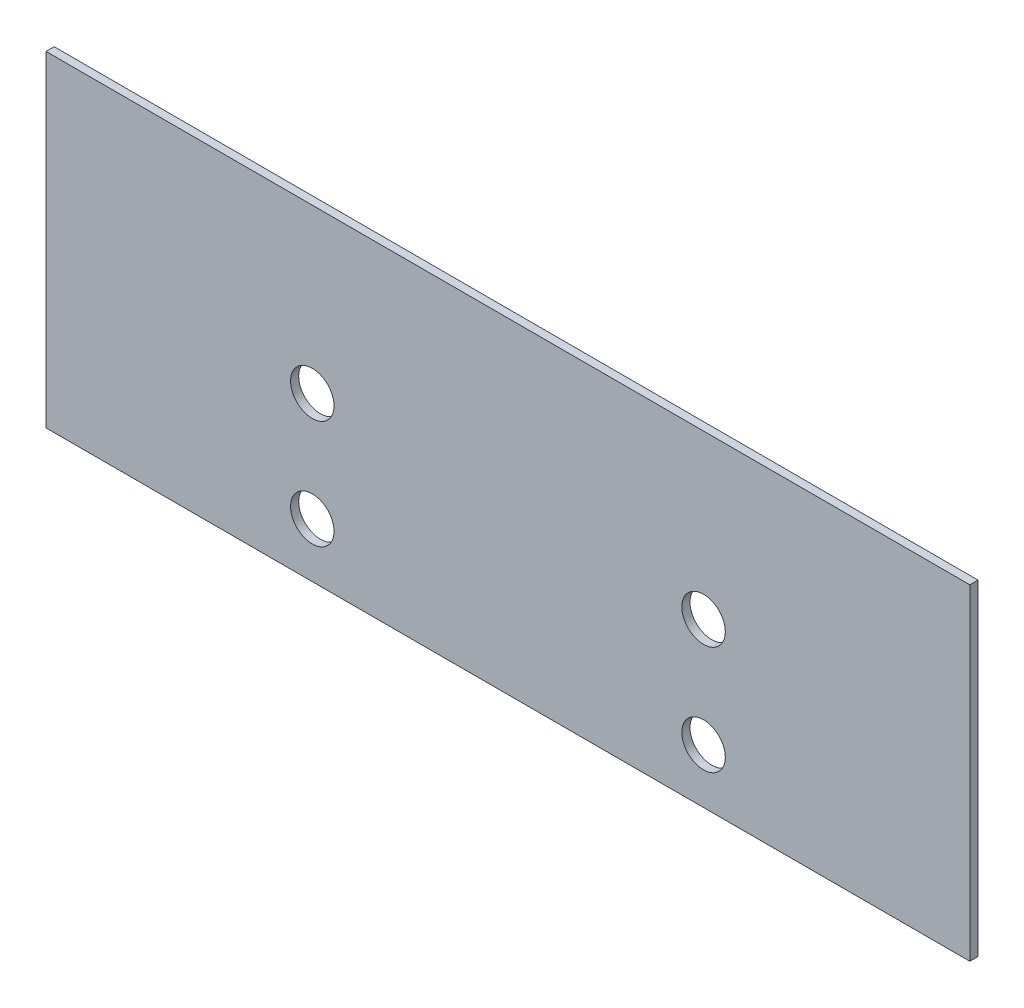
ISO-10303-21;
HEADER;
FILE_DESCRIPTION(('STEP AP214'),'2;1');
FILE_NAME('part.step','',(''),(''),'','','');
FILE_SCHEMA(('AUTOMOTIVE_DESIGN { 1 0 10303 214 1 1 1 1 }'));
ENDSEC;
DATA;
#1=APPLICATION_CONTEXT('core data for automotive mechanical design processes');
#2=APPLICATION_PROTOCOL_DEFINITION('international standard','automotive_design',2000,#1);
#3=PRODUCT_CONTEXT('',#1,'mechanical');
#4=PRODUCT('Part','Part','',(#3));
#5=PRODUCT_RELATED_PRODUCT_CATEGORY('part','',(#4));
#6=PRODUCT_DEFINITION_FORMATION('','',#4);
#7=PRODUCT_DEFINITION_CONTEXT('part definition',#1,'design');
#8=PRODUCT_DEFINITION('design','',#6,#7);
#9=PRODUCT_DEFINITION_SHAPE('','',#8);
#10=(LENGTH_UNIT() NAMED_UNIT(*) SI_UNIT(.MILLI.,.METRE.));
#11=(NAMED_UNIT(*) PLANE_ANGLE_UNIT() SI_UNIT($,.RADIAN.));
#12=(NAMED_UNIT(*) SI_UNIT($,.STERADIAN.) SOLID_ANGLE_UNIT());
#13=UNCERTAINTY_MEASURE_WITH_UNIT(LENGTH_MEASURE(1.E-05),#10,'distance_accuracy_value','');
#14=(GEOMETRIC_REPRESENTATION_CONTEXT(3) GLOBAL_UNCERTAINTY_ASSIGNED_CONTEXT((#13)) GLOBAL_UNIT_ASSIGNED_CONTEXT((#10,
#11,#12)) REPRESENTATION_CONTEXT('',''));
#15=CARTESIAN_POINT('',(0.,0.,0.));
#16=DIRECTION('',(0.,0.,1.));
#17=DIRECTION('',(1.,0.,0.));
#18=AXIS2_PLACEMENT_3D('',#15,#16,#17);
#19=CARTESIAN_POINT('',(85.0000000000001,-30.,1.5));
#20=DIRECTION('',(-1.,0.,0.));
#21=DIRECTION('',(0.,-1.,0.));
#22=AXIS2_PLACEMENT_3D('',#19,#20,#21);
#23=PLANE('',#22);
#24=DIRECTION('',(0.,1.,0.));
#25=VECTOR('',#24,1.);
#26=CARTESIAN_POINT('',(85.0000000000001,-30.,0.));
#27=LINE('',#26,#25);
#28=CARTESIAN_POINT('',(85.0000000000001,-30.,0.));
#29=VERTEX_POINT('',#28);
#30=CARTESIAN_POINT('',(85.0000000000001,30.,0.));
#31=VERTEX_POINT('',#30);
#32=EDGE_CURVE('E99',#29,#31,#27,.T.);
#33=ORIENTED_EDGE('',*,*,#32,.T.);
#34=DIRECTION('',(0.,0.,-1.));
#35=VECTOR('',#34,1.);
#36=CARTESIAN_POINT('',(85.0000000000001,30.,1.5));
#37=LINE('',#36,#35);
#38=CARTESIAN_POINT('',(85.0000000000001,30.,1.5));
#39=VERTEX_POINT('',#38);
#40=EDGE_CURVE('E11',#39,#31,#37,.T.);
#41=ORIENTED_EDGE('',*,*,#40,.F.);
#42=DIRECTION('',(0.,1.,0.));
#43=VECTOR('',#42,1.);
#44=CARTESIAN_POINT('',(85.0000000000001,-30.,1.5));
#45=LINE('',#44,#43);
#46=CARTESIAN_POINT('',(85.0000000000001,-30.,1.5));
#47=VERTEX_POINT('',#46);
#48=EDGE_CURVE('E87',#47,#39,#45,.T.);
#49=ORIENTED_EDGE('',*,*,#48,.F.);
#50=DIRECTION('',(0.,0.,-1.));
#51=VECTOR('',#50,1.);
#52=CARTESIAN_POINT('',(85.0000000000001,-30.,1.5));
#53=LINE('',#52,#51);
#54=EDGE_CURVE('E95',#47,#29,#53,.T.);
#55=ORIENTED_EDGE('',*,*,#54,.T.);
#56=EDGE_LOOP('',(#33,#41,#49,#55));
#57=FACE_BOUND('',#56,.T.);
#58=ADVANCED_FACE('F36',(#57),#23,.F.);
#59=CARTESIAN_POINT('',(-85.,30.,1.5));
#60=DIRECTION('',(0.,-1.,0.));
#61=DIRECTION('',(1.,0.,0.));
#62=AXIS2_PLACEMENT_3D('',#59,#60,#61);
#63=PLANE('',#62);
#64=DIRECTION('',(-1.,0.,0.));
#65=VECTOR('',#64,1.);
#66=CARTESIAN_POINT('',(-85.,30.,0.));
#67=LINE('',#66,#65);
#68=CARTESIAN_POINT('',(-85.,30.,0.));
#69=VERTEX_POINT('',#68);
#70=EDGE_CURVE('E91',#31,#69,#67,.T.);
#71=ORIENTED_EDGE('',*,*,#70,.T.);
#72=DIRECTION('',(0.,0.,-1.));
#73=VECTOR('',#72,1.);
#74=CARTESIAN_POINT('',(-85.,30.,1.5));
#75=LINE('',#74,#73);
#76=CARTESIAN_POINT('',(-85.,30.,1.5));
#77=VERTEX_POINT('',#76);
#78=EDGE_CURVE('E44',#77,#69,#75,.T.);
#79=ORIENTED_EDGE('',*,*,#78,.F.);
#80=DIRECTION('',(-1.,0.,0.));
#81=VECTOR('',#80,1.);
#82=CARTESIAN_POINT('',(-85.,30.,1.5));
#83=LINE('',#82,#81);
#84=EDGE_CURVE('E82',#39,#77,#83,.T.);
#85=ORIENTED_EDGE('',*,*,#84,.F.);
#86=ORIENTED_EDGE('',*,*,#40,.T.);
#87=EDGE_LOOP('',(#71,#79,#85,#86));
#88=FACE_BOUND('',#87,.T.);
#89=ADVANCED_FACE('F90',(#88),#63,.F.);
#90=CARTESIAN_POINT('',(-85.,-30.,1.5));
#91=DIRECTION('',(1.,0.,0.));
#92=DIRECTION('',(0.,0.,-1.));
#93=AXIS2_PLACEMENT_3D('',#90,#91,#92);
#94=PLANE('',#93);
#95=DIRECTION('',(0.,-1.,0.));
#96=VECTOR('',#95,1.);
#97=CARTESIAN_POINT('',(-85.,-30.,0.));
#98=LINE('',#97,#96);
#99=CARTESIAN_POINT('',(-85.,-30.,0.));
#100=VERTEX_POINT('',#99);
#101=EDGE_CURVE('E69',#69,#100,#98,.T.);
#102=ORIENTED_EDGE('',*,*,#101,.T.);
#103=DIRECTION('',(0.,0.,-1.));
#104=VECTOR('',#103,1.);
#105=CARTESIAN_POINT('',(-85.,-30.,1.5));
#106=LINE('',#105,#104);
#107=CARTESIAN_POINT('',(-85.,-30.,1.5));
#108=VERTEX_POINT('',#107);
#109=EDGE_CURVE('E92',#108,#100,#106,.T.);
#110=ORIENTED_EDGE('',*,*,#109,.F.);
#111=DIRECTION('',(0.,-1.,0.));
#112=VECTOR('',#111,1.);
#113=CARTESIAN_POINT('',(-85.,-30.,1.5));
#114=LINE('',#113,#112);
#115=EDGE_CURVE('E85',#77,#108,#114,.T.);
#116=ORIENTED_EDGE('',*,*,#115,.F.);
#117=ORIENTED_EDGE('',*,*,#78,.T.);
#118=EDGE_LOOP('',(#102,#110,#116,#117));
#119=FACE_BOUND('',#118,.T.);
#120=ADVANCED_FACE('F93',(#119),#94,.F.);
#121=CARTESIAN_POINT('',(-85.,-30.,1.5));
#122=DIRECTION('',(0.,1.,0.));
#123=DIRECTION('',(-1.,0.,0.));
#124=AXIS2_PLACEMENT_3D('',#121,#122,#123);
#125=PLANE('',#124);
#126=DIRECTION('',(1.,0.,0.));
#127=VECTOR('',#126,1.);
#128=CARTESIAN_POINT('',(-85.,-30.,0.));
#129=LINE('',#128,#127);
#130=EDGE_CURVE('E75',#100,#29,#129,.T.);
#131=ORIENTED_EDGE('',*,*,#130,.T.);
#132=ORIENTED_EDGE('',*,*,#54,.F.);
#133=DIRECTION('',(1.,0.,0.));
#134=VECTOR('',#133,1.);
#135=CARTESIAN_POINT('',(-85.,-30.,1.5));
#136=LINE('',#135,#134);
#137=EDGE_CURVE('E52',#108,#47,#136,.T.);
#138=ORIENTED_EDGE('',*,*,#137,.F.);
#139=ORIENTED_EDGE('',*,*,#109,.T.);
#140=EDGE_LOOP('',(#131,#132,#138,#139));
#141=FACE_BOUND('',#140,.T.);
#142=ADVANCED_FACE('F107',(#141),#125,.F.);
#143=CARTESIAN_POINT('',(0.,0.,1.5));
#144=DIRECTION('',(0.,0.,-1.));
#145=DIRECTION('',(-1.,0.,0.));
#146=AXIS2_PLACEMENT_3D('',#143,#144,#145);
#147=PLANE('',#146);
#148=CARTESIAN_POINT('',(-35.9999999901009,-3.28036209307214E-12,1.5));
#149=DIRECTION('',(0.,0.,1.));
#150=DIRECTION('',(1.,0.,0.));
#151=AXIS2_PLACEMENT_3D('',#148,#149,#150);
#152=CIRCLE('',#151,4.00000000000001);
#153=CARTESIAN_POINT('',(-31.9999999901009,-3.28036209307214E-12,1.5));
#154=VERTEX_POINT('',#153);
#155=EDGE_CURVE('E122',#154,#154,#152,.T.);
#156=ORIENTED_EDGE('',*,*,#155,.F.);
#157=EDGE_LOOP('',(#156));
#158=FACE_BOUND('',#157,.T.);
#159=CARTESIAN_POINT('',(36.0000000098991,-20.0000000000033,1.5));
#160=DIRECTION('',(0.,0.,1.));
#161=DIRECTION('',(1.,0.,0.));
#162=AXIS2_PLACEMENT_3D('',#159,#160,#161);
#163=CIRCLE('',#162,4.);
#164=CARTESIAN_POINT('',(40.0000000098991,-20.0000000000033,1.5));
#165=VERTEX_POINT('',#164);
#166=EDGE_CURVE('E123',#165,#165,#163,.T.);
#167=ORIENTED_EDGE('',*,*,#166,.F.);
#168=EDGE_LOOP('',(#167));
#169=FACE_BOUND('',#168,.T.);
#170=CARTESIAN_POINT('',(36.0000000098991,-3.28036209307214E-12,1.5));
#171=DIRECTION('',(0.,0.,1.));
#172=DIRECTION('',(1.,0.,0.));
#173=AXIS2_PLACEMENT_3D('',#170,#171,#172);
#174=CIRCLE('',#173,4.);
#175=CARTESIAN_POINT('',(40.0000000098991,-3.28036209307214E-12,1.5));
#176=VERTEX_POINT('',#175);
#177=EDGE_CURVE('E133',#176,#176,#174,.T.);
#178=ORIENTED_EDGE('',*,*,#177,.F.);
#179=EDGE_LOOP('',(#178));
#180=FACE_BOUND('',#179,.T.);
#181=CARTESIAN_POINT('',(-35.9999999901009,-20.0000000000033,1.5));
#182=DIRECTION('',(0.,0.,1.));
#183=DIRECTION('',(1.,0.,0.));
#184=AXIS2_PLACEMENT_3D('',#181,#182,#183);
#185=CIRCLE('',#184,4.00000000000001);
#186=CARTESIAN_POINT('',(-31.9999999901009,-20.0000000000033,1.5));
#187=VERTEX_POINT('',#186);
#188=EDGE_CURVE('E115',#187,#187,#185,.T.);
#189=ORIENTED_EDGE('',*,*,#188,.F.);
#190=EDGE_LOOP('',(#189));
#191=FACE_BOUND('',#190,.T.);
#192=ORIENTED_EDGE('',*,*,#48,.T.);
#193=ORIENTED_EDGE('',*,*,#84,.T.);
#194=ORIENTED_EDGE('',*,*,#115,.T.);
#195=ORIENTED_EDGE('',*,*,#137,.T.);
#196=EDGE_LOOP('',(#192,#193,#194,#195));
#197=FACE_BOUND('',#196,.T.);
#198=ADVANCED_FACE('F83',(#158,#169,#180,#191,#197),#147,.F.);
#199=CARTESIAN_POINT('',(0.,0.,0.));
#200=DIRECTION('',(0.,0.,-1.));
#201=DIRECTION('',(-1.,0.,0.));
#202=AXIS2_PLACEMENT_3D('',#199,#200,#201);
#203=PLANE('',#202);
#204=CARTESIAN_POINT('',(-35.9999999901009,-3.28036209307214E-12,0.));
#205=DIRECTION('',(0.,0.,-1.));
#206=DIRECTION('',(-1.,0.,0.));
#207=AXIS2_PLACEMENT_3D('',#204,#205,#206);
#208=CIRCLE('',#207,4.00000000000001);
#209=CARTESIAN_POINT('',(-39.9999999901009,-3.28036209307214E-12,0.));
#210=VERTEX_POINT('',#209);
#211=EDGE_CURVE('E118',#210,#210,#208,.F.);
#212=ORIENTED_EDGE('',*,*,#211,.T.);
#213=EDGE_LOOP('',(#212));
#214=FACE_BOUND('',#213,.T.);
#215=CARTESIAN_POINT('',(36.0000000098991,-20.0000000000033,0.));
#216=DIRECTION('',(0.,0.,-1.));
#217=DIRECTION('',(-1.,0.,0.));
#218=AXIS2_PLACEMENT_3D('',#215,#216,#217);
#219=CIRCLE('',#218,4.);
#220=CARTESIAN_POINT('',(32.0000000098991,-20.0000000000033,0.));
#221=VERTEX_POINT('',#220);
#222=EDGE_CURVE('E119',#221,#221,#219,.F.);
#223=ORIENTED_EDGE('',*,*,#222,.T.);
#224=EDGE_LOOP('',(#223));
#225=FACE_BOUND('',#224,.T.);
#226=CARTESIAN_POINT('',(36.0000000098991,-3.28036209307214E-12,0.));
#227=DIRECTION('',(0.,0.,-1.));
#228=DIRECTION('',(-1.,0.,0.));
#229=AXIS2_PLACEMENT_3D('',#226,#227,#228);
#230=CIRCLE('',#229,4.);
#231=CARTESIAN_POINT('',(32.0000000098991,-3.28036209307214E-12,0.));
#232=VERTEX_POINT('',#231);
#233=EDGE_CURVE('E126',#232,#232,#230,.F.);
#234=ORIENTED_EDGE('',*,*,#233,.T.);
#235=EDGE_LOOP('',(#234));
#236=FACE_BOUND('',#235,.T.);
#237=CARTESIAN_POINT('',(-35.9999999901009,-20.0000000000033,0.));
#238=DIRECTION('',(0.,0.,-1.));
#239=DIRECTION('',(-1.,0.,0.));
#240=AXIS2_PLACEMENT_3D('',#237,#238,#239);
#241=CIRCLE('',#240,4.00000000000001);
#242=CARTESIAN_POINT('',(-39.9999999901009,-20.0000000000033,0.));
#243=VERTEX_POINT('',#242);
#244=EDGE_CURVE('E102',#243,#243,#241,.F.);
#245=ORIENTED_EDGE('',*,*,#244,.T.);
#246=EDGE_LOOP('',(#245));
#247=FACE_BOUND('',#246,.T.);
#248=ORIENTED_EDGE('',*,*,#32,.F.);
#249=ORIENTED_EDGE('',*,*,#130,.F.);
#250=ORIENTED_EDGE('',*,*,#101,.F.);
#251=ORIENTED_EDGE('',*,*,#70,.F.);
#252=EDGE_LOOP('',(#248,#249,#250,#251));
#253=FACE_BOUND('',#252,.T.);
#254=ADVANCED_FACE('F110',(#214,#225,#236,#247,#253),#203,.T.);
#255=CARTESIAN_POINT('',(-35.9999999901009,-20.0000000000033,-11.3137084989848));
#256=DIRECTION('',(0.,0.,1.));
#257=DIRECTION('',(1.,0.,0.));
#258=AXIS2_PLACEMENT_3D('',#255,#256,#257);
#259=CYLINDRICAL_SURFACE('',#258,4.00000000000001);
#260=ORIENTED_EDGE('',*,*,#188,.T.);
#261=EDGE_LOOP('',(#260));
#262=FACE_BOUND('',#261,.T.);
#263=ORIENTED_EDGE('',*,*,#244,.F.);
#264=EDGE_LOOP('',(#263));
#265=FACE_BOUND('',#264,.T.);
#266=ADVANCED_FACE('F146',(#262,#265),#259,.F.);
#267=CARTESIAN_POINT('',(36.0000000098991,-3.28036209307214E-12,-11.3137084989848));
#268=DIRECTION('',(0.,0.,1.));
#269=DIRECTION('',(1.,0.,0.));
#270=AXIS2_PLACEMENT_3D('',#267,#268,#269);
#271=CYLINDRICAL_SURFACE('',#270,4.);
#272=ORIENTED_EDGE('',*,*,#177,.T.);
#273=EDGE_LOOP('',(#272));
#274=FACE_BOUND('',#273,.T.);
#275=ORIENTED_EDGE('',*,*,#233,.F.);
#276=EDGE_LOOP('',(#275));
#277=FACE_BOUND('',#276,.T.);
#278=ADVANCED_FACE('F137',(#274,#277),#271,.F.);
#279=CARTESIAN_POINT('',(36.0000000098991,-20.0000000000033,-11.3137084989848));
#280=DIRECTION('',(0.,0.,1.));
#281=DIRECTION('',(1.,0.,0.));
#282=AXIS2_PLACEMENT_3D('',#279,#280,#281);
#283=CYLINDRICAL_SURFACE('',#282,4.);
#284=ORIENTED_EDGE('',*,*,#166,.T.);
#285=EDGE_LOOP('',(#284));
#286=FACE_BOUND('',#285,.T.);
#287=ORIENTED_EDGE('',*,*,#222,.F.);
#288=EDGE_LOOP('',(#287));
#289=FACE_BOUND('',#288,.T.);
#290=ADVANCED_FACE('F195',(#286,#289),#283,.F.);
#291=CARTESIAN_POINT('',(-35.9999999901009,-3.28036209307214E-12,-11.3137084989848));
#292=DIRECTION('',(0.,0.,1.));
#293=DIRECTION('',(1.,0.,0.));
#294=AXIS2_PLACEMENT_3D('',#291,#292,#293);
#295=CYLINDRICAL_SURFACE('',#294,4.00000000000001);
#296=ORIENTED_EDGE('',*,*,#155,.T.);
#297=EDGE_LOOP('',(#296));
#298=FACE_BOUND('',#297,.T.);
#299=ORIENTED_EDGE('',*,*,#211,.F.);
#300=EDGE_LOOP('',(#299));
#301=FACE_BOUND('',#300,.T.);
#302=ADVANCED_FACE('F204',(#298,#301),#295,.F.);
#303=CLOSED_SHELL('',(#58,#89,#120,#142,#198,#254,#266,#278,#290,#302));
#304=MANIFOLD_SOLID_BREP('B2',#303);
#305=ADVANCED_BREP_SHAPE_REPRESENTATION('',(#18,#304),#14);
#306=SHAPE_DEFINITION_REPRESENTATION(#9,#305);
ENDSEC;
END-ISO-10303-21;
